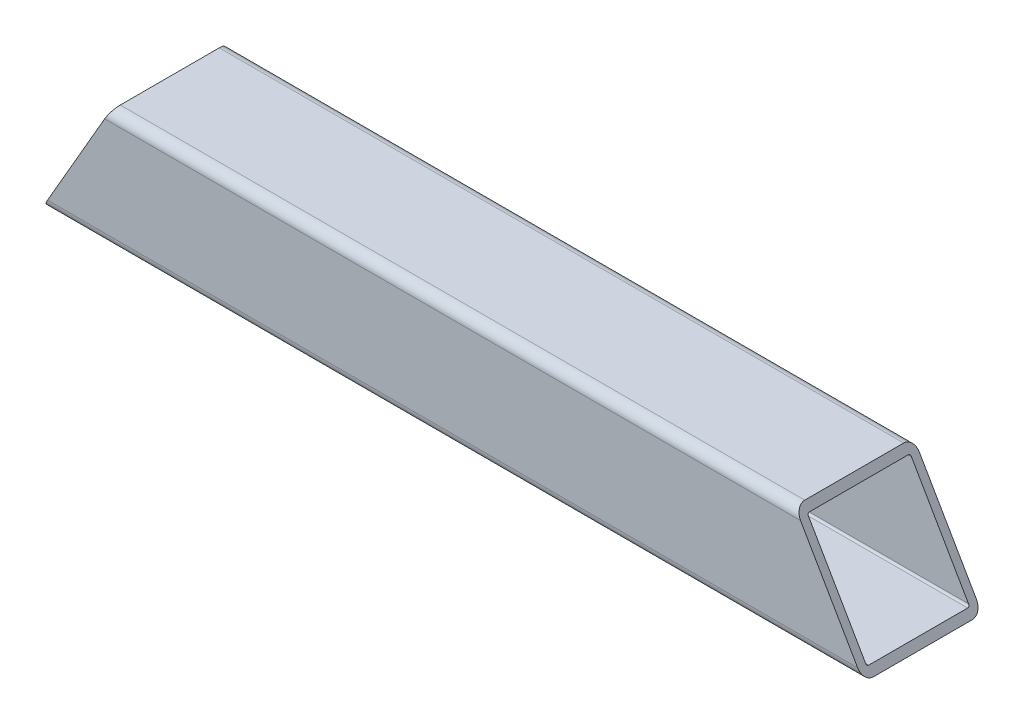
ISO-10303-21;
HEADER;
FILE_DESCRIPTION(('STEP AP214'),'2;1');
FILE_NAME('part.step','',(''),(''),'','','');
FILE_SCHEMA(('AUTOMOTIVE_DESIGN { 1 0 10303 214 1 1 1 1 }'));
ENDSEC;
DATA;
#1=APPLICATION_CONTEXT('core data for automotive mechanical design processes');
#2=APPLICATION_PROTOCOL_DEFINITION('international standard','automotive_design',2000,#1);
#3=PRODUCT_CONTEXT('',#1,'mechanical');
#4=PRODUCT('Part','Part','',(#3));
#5=PRODUCT_RELATED_PRODUCT_CATEGORY('part','',(#4));
#6=PRODUCT_DEFINITION_FORMATION('','',#4);
#7=PRODUCT_DEFINITION_CONTEXT('part definition',#1,'design');
#8=PRODUCT_DEFINITION('design','',#6,#7);
#9=PRODUCT_DEFINITION_SHAPE('','',#8);
#10=(LENGTH_UNIT() NAMED_UNIT(*) SI_UNIT(.MILLI.,.METRE.));
#11=(NAMED_UNIT(*) PLANE_ANGLE_UNIT() SI_UNIT($,.RADIAN.));
#12=(NAMED_UNIT(*) SI_UNIT($,.STERADIAN.) SOLID_ANGLE_UNIT());
#13=UNCERTAINTY_MEASURE_WITH_UNIT(LENGTH_MEASURE(1.E-05),#10,'distance_accuracy_value','');
#14=(GEOMETRIC_REPRESENTATION_CONTEXT(3) GLOBAL_UNCERTAINTY_ASSIGNED_CONTEXT((#13)) GLOBAL_UNIT_ASSIGNED_CONTEXT((#10,
#11,#12)) REPRESENTATION_CONTEXT('',''));
#15=CARTESIAN_POINT('',(0.,0.,0.));
#16=DIRECTION('',(0.,0.,1.));
#17=DIRECTION('',(1.,0.,0.));
#18=AXIS2_PLACEMENT_3D('',#15,#16,#17);
#19=CARTESIAN_POINT('',(131.7625,-15.875,15.875));
#20=DIRECTION('',(-1.,0.,0.));
#21=DIRECTION('',(0.,0.,1.));
#22=AXIS2_PLACEMENT_3D('',#19,#20,#21);
#23=CYLINDRICAL_SURFACE('',#22,3.175);
#24=DIRECTION('',(-1.,0.,0.));
#25=VECTOR('',#24,1.);
#26=CARTESIAN_POINT('',(131.7625,-19.05,15.875));
#27=LINE('',#26,#25);
#28=CARTESIAN_POINT('',(131.7625,-19.05,15.875));
#29=VERTEX_POINT('',#28);
#30=CARTESIAN_POINT('',(-131.7625,-19.05,15.875));
#31=VERTEX_POINT('',#30);
#32=EDGE_CURVE('E88',#29,#31,#27,.T.);
#33=ORIENTED_EDGE('',*,*,#32,.F.);
#34=CARTESIAN_POINT('',(129.929412895323,-15.875,15.875));
#35=DIRECTION('',(-0.866025403784442,-0.499999999999995,0.));
#36=DIRECTION('',(-0.499999999999995,0.866025403784442,0.));
#37=AXIS2_PLACEMENT_3D('',#34,#35,#36);
#38=ELLIPSE('',#37,3.66617420935411,3.175);
#39=CARTESIAN_POINT('',(129.929412895323,-15.875,19.05));
#40=VERTEX_POINT('',#39);
#41=EDGE_CURVE('E216',#29,#40,#38,.T.);
#42=ORIENTED_EDGE('',*,*,#41,.T.);
#43=DIRECTION('',(-1.,0.,0.));
#44=VECTOR('',#43,1.);
#45=CARTESIAN_POINT('',(131.7625,-15.875,19.05));
#46=LINE('',#45,#44);
#47=CARTESIAN_POINT('',(-129.929412895323,-15.875,19.05));
#48=VERTEX_POINT('',#47);
#49=EDGE_CURVE('E217',#40,#48,#46,.T.);
#50=ORIENTED_EDGE('',*,*,#49,.T.);
#51=CARTESIAN_POINT('',(-129.929412895323,-15.875,15.875));
#52=DIRECTION('',(-0.866025403784442,0.499999999999995,0.));
#53=DIRECTION('',(-0.499999999999995,-0.866025403784442,0.));
#54=AXIS2_PLACEMENT_3D('',#51,#52,#53);
#55=ELLIPSE('',#54,3.66617420935411,3.175);
#56=EDGE_CURVE('E239',#31,#48,#55,.T.);
#57=ORIENTED_EDGE('',*,*,#56,.F.);
#58=EDGE_LOOP('',(#33,#42,#50,#57));
#59=FACE_BOUND('',#58,.T.);
#60=ADVANCED_FACE('F81',(#59),#23,.T.);
#61=CARTESIAN_POINT('',(131.7625,-15.875,-15.875));
#62=DIRECTION('',(-1.,0.,0.));
#63=DIRECTION('',(0.,0.,1.));
#64=AXIS2_PLACEMENT_3D('',#61,#62,#63);
#65=CYLINDRICAL_SURFACE('',#64,3.175);
#66=DIRECTION('',(-1.,0.,0.));
#67=VECTOR('',#66,1.);
#68=CARTESIAN_POINT('',(131.7625,-15.875,-19.05));
#69=LINE('',#68,#67);
#70=CARTESIAN_POINT('',(129.929412895323,-15.875,-19.05));
#71=VERTEX_POINT('',#70);
#72=CARTESIAN_POINT('',(-129.929412895323,-15.875,-19.05));
#73=VERTEX_POINT('',#72);
#74=EDGE_CURVE('E205',#71,#73,#69,.T.);
#75=ORIENTED_EDGE('',*,*,#74,.F.);
#76=CARTESIAN_POINT('',(129.929412895323,-15.875,-15.875));
#77=DIRECTION('',(-0.866025403784442,-0.499999999999995,0.));
#78=DIRECTION('',(-0.499999999999995,0.866025403784442,0.));
#79=AXIS2_PLACEMENT_3D('',#76,#77,#78);
#80=ELLIPSE('',#79,3.66617420935411,3.175);
#81=CARTESIAN_POINT('',(131.7625,-19.05,-15.875));
#82=VERTEX_POINT('',#81);
#83=EDGE_CURVE('E208',#71,#82,#80,.T.);
#84=ORIENTED_EDGE('',*,*,#83,.T.);
#85=DIRECTION('',(-1.,0.,0.));
#86=VECTOR('',#85,1.);
#87=CARTESIAN_POINT('',(131.7625,-19.05,-15.875));
#88=LINE('',#87,#86);
#89=CARTESIAN_POINT('',(-131.7625,-19.05,-15.875));
#90=VERTEX_POINT('',#89);
#91=EDGE_CURVE('E193',#82,#90,#88,.T.);
#92=ORIENTED_EDGE('',*,*,#91,.T.);
#93=CARTESIAN_POINT('',(-129.929412895323,-15.875,-15.875));
#94=DIRECTION('',(-0.866025403784442,0.499999999999995,0.));
#95=DIRECTION('',(-0.499999999999995,-0.866025403784442,0.));
#96=AXIS2_PLACEMENT_3D('',#93,#94,#95);
#97=ELLIPSE('',#96,3.66617420935411,3.175);
#98=EDGE_CURVE('E240',#73,#90,#97,.T.);
#99=ORIENTED_EDGE('',*,*,#98,.F.);
#100=EDGE_LOOP('',(#75,#84,#92,#99));
#101=FACE_BOUND('',#100,.T.);
#102=ADVANCED_FACE('F209',(#101),#65,.T.);
#103=CARTESIAN_POINT('',(131.7625,15.875,-19.05));
#104=DIRECTION('',(0.,0.,1.));
#105=DIRECTION('',(0.,-1.,0.));
#106=AXIS2_PLACEMENT_3D('',#103,#104,#105);
#107=PLANE('',#106);
#108=DIRECTION('',(-1.,0.,0.));
#109=VECTOR('',#108,1.);
#110=CARTESIAN_POINT('',(131.7625,15.875,-19.05));
#111=LINE('',#110,#109);
#112=CARTESIAN_POINT('',(111.598541848553,15.875,-19.05));
#113=VERTEX_POINT('',#112);
#114=CARTESIAN_POINT('',(-111.598541848553,15.875,-19.05));
#115=VERTEX_POINT('',#114);
#116=EDGE_CURVE('E231',#113,#115,#111,.T.);
#117=ORIENTED_EDGE('',*,*,#116,.F.);
#118=DIRECTION('',(0.499999999999995,-0.866025403784442,0.));
#119=VECTOR('',#118,1.);
#120=CARTESIAN_POINT('',(116.639531386414,7.14375000000017,-19.05));
#121=LINE('',#120,#119);
#122=EDGE_CURVE('E95',#113,#71,#121,.T.);
#123=ORIENTED_EDGE('',*,*,#122,.T.);
#124=ORIENTED_EDGE('',*,*,#74,.T.);
#125=DIRECTION('',(-0.499999999999995,-0.866025403784442,0.));
#126=VECTOR('',#125,1.);
#127=CARTESIAN_POINT('',(-50.7582813864157,121.253422266146,-19.05));
#128=LINE('',#127,#126);
#129=EDGE_CURVE('E243',#115,#73,#128,.T.);
#130=ORIENTED_EDGE('',*,*,#129,.F.);
#131=EDGE_LOOP('',(#117,#123,#124,#130));
#132=FACE_BOUND('',#131,.T.);
#133=ADVANCED_FACE('F298',(#132),#107,.F.);
#134=CARTESIAN_POINT('',(131.7625,15.875,-15.875));
#135=DIRECTION('',(-1.,0.,0.));
#136=DIRECTION('',(0.,0.,1.));
#137=AXIS2_PLACEMENT_3D('',#134,#135,#136);
#138=CYLINDRICAL_SURFACE('',#137,3.175);
#139=DIRECTION('',(-1.,0.,0.));
#140=VECTOR('',#139,1.);
#141=CARTESIAN_POINT('',(131.7625,19.05,-15.875));
#142=LINE('',#141,#140);
#143=CARTESIAN_POINT('',(109.765454743876,19.05,-15.875));
#144=VERTEX_POINT('',#143);
#145=CARTESIAN_POINT('',(-109.765454743876,19.05,-15.875));
#146=VERTEX_POINT('',#145);
#147=EDGE_CURVE('E229',#144,#146,#142,.T.);
#148=ORIENTED_EDGE('',*,*,#147,.F.);
#149=CARTESIAN_POINT('',(111.598541848553,15.875,-15.875));
#150=DIRECTION('',(-0.866025403784442,-0.499999999999995,0.));
#151=DIRECTION('',(-0.499999999999995,0.866025403784442,0.));
#152=AXIS2_PLACEMENT_3D('',#149,#150,#151);
#153=ELLIPSE('',#152,3.66617420935412,3.175);
#154=EDGE_CURVE('E103',#144,#113,#153,.T.);
#155=ORIENTED_EDGE('',*,*,#154,.T.);
#156=ORIENTED_EDGE('',*,*,#116,.T.);
#157=CARTESIAN_POINT('',(-111.598541848553,15.875,-15.875));
#158=DIRECTION('',(-0.866025403784442,0.499999999999995,0.));
#159=DIRECTION('',(-0.499999999999995,-0.866025403784442,0.));
#160=AXIS2_PLACEMENT_3D('',#157,#158,#159);
#161=ELLIPSE('',#160,3.66617420935412,3.175);
#162=EDGE_CURVE('E248',#146,#115,#161,.T.);
#163=ORIENTED_EDGE('',*,*,#162,.F.);
#164=EDGE_LOOP('',(#148,#155,#156,#163));
#165=FACE_BOUND('',#164,.T.);
#166=ADVANCED_FACE('F297',(#165),#138,.T.);
#167=CARTESIAN_POINT('',(131.7625,19.05,15.875));
#168=DIRECTION('',(0.,-1.,0.));
#169=DIRECTION('',(0.,0.,-1.));
#170=AXIS2_PLACEMENT_3D('',#167,#168,#169);
#171=PLANE('',#170);
#172=DIRECTION('',(-1.,0.,0.));
#173=VECTOR('',#172,1.);
#174=CARTESIAN_POINT('',(131.7625,19.05,15.875));
#175=LINE('',#174,#173);
#176=CARTESIAN_POINT('',(109.765454743876,19.05,15.875));
#177=VERTEX_POINT('',#176);
#178=CARTESIAN_POINT('',(-109.765454743876,19.05,15.875));
#179=VERTEX_POINT('',#178);
#180=EDGE_CURVE('E227',#177,#179,#175,.T.);
#181=ORIENTED_EDGE('',*,*,#180,.F.);
#182=DIRECTION('',(0.,0.,-1.));
#183=VECTOR('',#182,1.);
#184=CARTESIAN_POINT('',(109.765454743876,19.05,359.240044371821));
#185=LINE('',#184,#183);
#186=EDGE_CURVE('E508',#177,#144,#185,.T.);
#187=ORIENTED_EDGE('',*,*,#186,.T.);
#188=ORIENTED_EDGE('',*,*,#147,.T.);
#189=DIRECTION('',(0.,0.,-1.));
#190=VECTOR('',#189,1.);
#191=CARTESIAN_POINT('',(-109.765454743876,19.05,359.240044371821));
#192=LINE('',#191,#190);
#193=EDGE_CURVE('E211',#179,#146,#192,.T.);
#194=ORIENTED_EDGE('',*,*,#193,.F.);
#195=EDGE_LOOP('',(#181,#187,#188,#194));
#196=FACE_BOUND('',#195,.T.);
#197=ADVANCED_FACE('F305',(#196),#171,.F.);
#198=CARTESIAN_POINT('',(131.7625,15.875,15.875));
#199=DIRECTION('',(-1.,0.,0.));
#200=DIRECTION('',(0.,0.,1.));
#201=AXIS2_PLACEMENT_3D('',#198,#199,#200);
#202=CYLINDRICAL_SURFACE('',#201,3.175);
#203=DIRECTION('',(-1.,0.,0.));
#204=VECTOR('',#203,1.);
#205=CARTESIAN_POINT('',(131.7625,15.875,19.05));
#206=LINE('',#205,#204);
#207=CARTESIAN_POINT('',(111.598541848553,15.875,19.05));
#208=VERTEX_POINT('',#207);
#209=CARTESIAN_POINT('',(-111.598541848553,15.875,19.05));
#210=VERTEX_POINT('',#209);
#211=EDGE_CURVE('E219',#208,#210,#206,.T.);
#212=ORIENTED_EDGE('',*,*,#211,.F.);
#213=CARTESIAN_POINT('',(111.598541848553,15.875,15.875));
#214=DIRECTION('',(-0.866025403784442,-0.499999999999995,0.));
#215=DIRECTION('',(-0.499999999999995,0.866025403784442,0.));
#216=AXIS2_PLACEMENT_3D('',#213,#214,#215);
#217=ELLIPSE('',#216,3.66617420935412,3.175);
#218=EDGE_CURVE('E473',#208,#177,#217,.T.);
#219=ORIENTED_EDGE('',*,*,#218,.T.);
#220=ORIENTED_EDGE('',*,*,#180,.T.);
#221=CARTESIAN_POINT('',(-111.598541848553,15.875,15.875));
#222=DIRECTION('',(-0.866025403784442,0.499999999999995,0.));
#223=DIRECTION('',(-0.499999999999995,-0.866025403784442,0.));
#224=AXIS2_PLACEMENT_3D('',#221,#222,#223);
#225=ELLIPSE('',#224,3.66617420935412,3.175);
#226=EDGE_CURVE('E291',#210,#179,#225,.T.);
#227=ORIENTED_EDGE('',*,*,#226,.F.);
#228=EDGE_LOOP('',(#212,#219,#220,#227));
#229=FACE_BOUND('',#228,.T.);
#230=ADVANCED_FACE('F335',(#229),#202,.T.);
#231=CARTESIAN_POINT('',(131.7625,15.875,19.05));
#232=DIRECTION('',(0.,0.,-1.));
#233=DIRECTION('',(0.,1.,0.));
#234=AXIS2_PLACEMENT_3D('',#231,#232,#233);
#235=PLANE('',#234);
#236=ORIENTED_EDGE('',*,*,#49,.F.);
#237=DIRECTION('',(-0.499999999999995,0.866025403784442,0.));
#238=VECTOR('',#237,1.);
#239=CARTESIAN_POINT('',(116.639531386414,7.14375000000017,19.05));
#240=LINE('',#239,#238);
#241=EDGE_CURVE('E466',#40,#208,#240,.T.);
#242=ORIENTED_EDGE('',*,*,#241,.T.);
#243=ORIENTED_EDGE('',*,*,#211,.T.);
#244=DIRECTION('',(0.499999999999995,0.866025403784442,0.));
#245=VECTOR('',#244,1.);
#246=CARTESIAN_POINT('',(-50.7582813864157,121.253422266146,19.05));
#247=LINE('',#246,#245);
#248=EDGE_CURVE('E281',#48,#210,#247,.T.);
#249=ORIENTED_EDGE('',*,*,#248,.F.);
#250=EDGE_LOOP('',(#236,#242,#243,#249));
#251=FACE_BOUND('',#250,.T.);
#252=ADVANCED_FACE('F345',(#251),#235,.F.);
#253=CARTESIAN_POINT('',(131.7625,-15.875,15.875));
#254=DIRECTION('',(-1.,0.,0.));
#255=DIRECTION('',(0.,0.,1.));
#256=AXIS2_PLACEMENT_3D('',#253,#254,#255);
#257=CYLINDRICAL_SURFACE('',#256,0.635000000000002);
#258=CARTESIAN_POINT('',(129.929412895323,-15.875,15.875));
#259=DIRECTION('',(-0.866025403784442,-0.499999999999995,0.));
#260=DIRECTION('',(-0.499999999999995,0.866025403784442,0.));
#261=AXIS2_PLACEMENT_3D('',#258,#259,#260);
#262=ELLIPSE('',#261,0.733234841870825,0.635000000000002);
#263=CARTESIAN_POINT('',(130.296030316258,-16.51,15.875));
#264=VERTEX_POINT('',#263);
#265=CARTESIAN_POINT('',(129.929412895323,-15.875,16.51));
#266=VERTEX_POINT('',#265);
#267=EDGE_CURVE('E273',#264,#266,#262,.T.);
#268=ORIENTED_EDGE('',*,*,#267,.F.);
#269=DIRECTION('',(-1.,0.,0.));
#270=VECTOR('',#269,1.);
#271=CARTESIAN_POINT('',(131.7625,-16.51,15.875));
#272=LINE('',#271,#270);
#273=CARTESIAN_POINT('',(-130.296030316258,-16.51,15.875));
#274=VERTEX_POINT('',#273);
#275=EDGE_CURVE('E221',#264,#274,#272,.T.);
#276=ORIENTED_EDGE('',*,*,#275,.T.);
#277=CARTESIAN_POINT('',(-129.929412895323,-15.875,15.875));
#278=DIRECTION('',(-0.866025403784442,0.499999999999995,0.));
#279=DIRECTION('',(-0.499999999999995,-0.866025403784442,0.));
#280=AXIS2_PLACEMENT_3D('',#277,#278,#279);
#281=ELLIPSE('',#280,0.733234841870825,0.635000000000002);
#282=CARTESIAN_POINT('',(-129.929412895323,-15.875,16.51));
#283=VERTEX_POINT('',#282);
#284=EDGE_CURVE('E271',#274,#283,#281,.T.);
#285=ORIENTED_EDGE('',*,*,#284,.T.);
#286=DIRECTION('',(-1.,0.,0.));
#287=VECTOR('',#286,1.);
#288=CARTESIAN_POINT('',(131.7625,-15.875,16.51));
#289=LINE('',#288,#287);
#290=EDGE_CURVE('E244',#266,#283,#289,.T.);
#291=ORIENTED_EDGE('',*,*,#290,.F.);
#292=EDGE_LOOP('',(#268,#276,#285,#291));
#293=FACE_BOUND('',#292,.T.);
#294=ADVANCED_FACE('F269',(#293),#257,.F.);
#295=CARTESIAN_POINT('',(131.7625,-16.51,15.875));
#296=DIRECTION('',(0.,1.,0.));
#297=DIRECTION('',(0.,0.,1.));
#298=AXIS2_PLACEMENT_3D('',#295,#296,#297);
#299=PLANE('',#298);
#300=DIRECTION('',(0.,0.,1.));
#301=VECTOR('',#300,1.);
#302=CARTESIAN_POINT('',(130.296030316258,-16.51,15.875));
#303=LINE('',#302,#301);
#304=CARTESIAN_POINT('',(130.296030316258,-16.51,-15.875));
#305=VERTEX_POINT('',#304);
#306=EDGE_CURVE('E461',#305,#264,#303,.T.);
#307=ORIENTED_EDGE('',*,*,#306,.F.);
#308=DIRECTION('',(-1.,0.,0.));
#309=VECTOR('',#308,1.);
#310=CARTESIAN_POINT('',(131.7625,-16.51,-15.875));
#311=LINE('',#310,#309);
#312=CARTESIAN_POINT('',(-130.296030316258,-16.51,-15.875));
#313=VERTEX_POINT('',#312);
#314=EDGE_CURVE('E260',#305,#313,#311,.T.);
#315=ORIENTED_EDGE('',*,*,#314,.T.);
#316=DIRECTION('',(0.,0.,1.));
#317=VECTOR('',#316,1.);
#318=CARTESIAN_POINT('',(-130.296030316258,-16.51,15.875));
#319=LINE('',#318,#317);
#320=EDGE_CURVE('E278',#313,#274,#319,.T.);
#321=ORIENTED_EDGE('',*,*,#320,.T.);
#322=ORIENTED_EDGE('',*,*,#275,.F.);
#323=EDGE_LOOP('',(#307,#315,#321,#322));
#324=FACE_BOUND('',#323,.T.);
#325=ADVANCED_FACE('F283',(#324),#299,.T.);
#326=CARTESIAN_POINT('',(131.7625,-15.875,-15.875));
#327=DIRECTION('',(-1.,0.,0.));
#328=DIRECTION('',(0.,0.,1.));
#329=AXIS2_PLACEMENT_3D('',#326,#327,#328);
#330=CYLINDRICAL_SURFACE('',#329,0.634999999999999);
#331=CARTESIAN_POINT('',(129.929412895323,-15.875,-15.875));
#332=DIRECTION('',(-0.866025403784442,-0.499999999999995,0.));
#333=DIRECTION('',(-0.499999999999995,0.866025403784442,0.));
#334=AXIS2_PLACEMENT_3D('',#331,#332,#333);
#335=ELLIPSE('',#334,0.733234841870821,0.634999999999999);
#336=CARTESIAN_POINT('',(129.929412895323,-15.875,-16.51));
#337=VERTEX_POINT('',#336);
#338=EDGE_CURVE('E464',#337,#305,#335,.T.);
#339=ORIENTED_EDGE('',*,*,#338,.F.);
#340=DIRECTION('',(-1.,0.,0.));
#341=VECTOR('',#340,1.);
#342=CARTESIAN_POINT('',(131.7625,-15.875,-16.51));
#343=LINE('',#342,#341);
#344=CARTESIAN_POINT('',(-129.929412895323,-15.875,-16.51));
#345=VERTEX_POINT('',#344);
#346=EDGE_CURVE('E259',#337,#345,#343,.T.);
#347=ORIENTED_EDGE('',*,*,#346,.T.);
#348=CARTESIAN_POINT('',(-129.929412895323,-15.875,-15.875));
#349=DIRECTION('',(-0.866025403784442,0.499999999999995,0.));
#350=DIRECTION('',(-0.499999999999995,-0.866025403784442,0.));
#351=AXIS2_PLACEMENT_3D('',#348,#349,#350);
#352=ELLIPSE('',#351,0.733234841870821,0.634999999999999);
#353=EDGE_CURVE('E284',#345,#313,#352,.T.);
#354=ORIENTED_EDGE('',*,*,#353,.T.);
#355=ORIENTED_EDGE('',*,*,#314,.F.);
#356=EDGE_LOOP('',(#339,#347,#354,#355));
#357=FACE_BOUND('',#356,.T.);
#358=ADVANCED_FACE('F372',(#357),#330,.F.);
#359=CARTESIAN_POINT('',(131.7625,15.875,-16.51));
#360=DIRECTION('',(0.,0.,1.));
#361=DIRECTION('',(0.,-1.,0.));
#362=AXIS2_PLACEMENT_3D('',#359,#360,#361);
#363=PLANE('',#362);
#364=DIRECTION('',(0.499999999999995,-0.866025403784442,0.));
#365=VECTOR('',#364,1.);
#366=CARTESIAN_POINT('',(116.639531386414,7.14375000000017,-16.51));
#367=LINE('',#366,#365);
#368=CARTESIAN_POINT('',(111.598541848553,15.875,-16.51));
#369=VERTEX_POINT('',#368);
#370=EDGE_CURVE('E468',#369,#337,#367,.T.);
#371=ORIENTED_EDGE('',*,*,#370,.F.);
#372=DIRECTION('',(-1.,0.,0.));
#373=VECTOR('',#372,1.);
#374=CARTESIAN_POINT('',(131.7625,15.875,-16.51));
#375=LINE('',#374,#373);
#376=CARTESIAN_POINT('',(-111.598541848553,15.875,-16.51));
#377=VERTEX_POINT('',#376);
#378=EDGE_CURVE('E257',#369,#377,#375,.T.);
#379=ORIENTED_EDGE('',*,*,#378,.T.);
#380=DIRECTION('',(-0.499999999999995,-0.866025403784442,0.));
#381=VECTOR('',#380,1.);
#382=CARTESIAN_POINT('',(-50.7582813864157,121.253422266146,-16.51));
#383=LINE('',#382,#381);
#384=EDGE_CURVE('E286',#377,#345,#383,.T.);
#385=ORIENTED_EDGE('',*,*,#384,.T.);
#386=ORIENTED_EDGE('',*,*,#346,.F.);
#387=EDGE_LOOP('',(#371,#379,#385,#386));
#388=FACE_BOUND('',#387,.T.);
#389=ADVANCED_FACE('F381',(#388),#363,.T.);
#390=CARTESIAN_POINT('',(131.7625,15.875,-15.875));
#391=DIRECTION('',(-1.,0.,0.));
#392=DIRECTION('',(0.,0.,1.));
#393=AXIS2_PLACEMENT_3D('',#390,#391,#392);
#394=CYLINDRICAL_SURFACE('',#393,0.635000000000004);
#395=CARTESIAN_POINT('',(111.598541848553,15.875,-15.875));
#396=DIRECTION('',(-0.866025403784442,-0.499999999999995,0.));
#397=DIRECTION('',(-0.499999999999995,0.866025403784442,0.));
#398=AXIS2_PLACEMENT_3D('',#395,#396,#397);
#399=ELLIPSE('',#398,0.733234841870827,0.635000000000004);
#400=CARTESIAN_POINT('',(111.231924427617,16.51,-15.875));
#401=VERTEX_POINT('',#400);
#402=EDGE_CURVE('E495',#401,#369,#399,.T.);
#403=ORIENTED_EDGE('',*,*,#402,.F.);
#404=DIRECTION('',(-1.,0.,0.));
#405=VECTOR('',#404,1.);
#406=CARTESIAN_POINT('',(131.7625,16.51,-15.875));
#407=LINE('',#406,#405);
#408=CARTESIAN_POINT('',(-111.231924427617,16.51,-15.875));
#409=VERTEX_POINT('',#408);
#410=EDGE_CURVE('E255',#401,#409,#407,.T.);
#411=ORIENTED_EDGE('',*,*,#410,.T.);
#412=CARTESIAN_POINT('',(-111.598541848553,15.875,-15.875));
#413=DIRECTION('',(-0.866025403784442,0.499999999999995,0.));
#414=DIRECTION('',(-0.499999999999995,-0.866025403784442,0.));
#415=AXIS2_PLACEMENT_3D('',#412,#413,#414);
#416=ELLIPSE('',#415,0.733234841870827,0.635000000000004);
#417=EDGE_CURVE('E485',#409,#377,#416,.T.);
#418=ORIENTED_EDGE('',*,*,#417,.T.);
#419=ORIENTED_EDGE('',*,*,#378,.F.);
#420=EDGE_LOOP('',(#403,#411,#418,#419));
#421=FACE_BOUND('',#420,.T.);
#422=ADVANCED_FACE('F391',(#421),#394,.F.);
#423=CARTESIAN_POINT('',(131.7625,16.51,15.875));
#424=DIRECTION('',(0.,-1.,0.));
#425=DIRECTION('',(0.,0.,-1.));
#426=AXIS2_PLACEMENT_3D('',#423,#424,#425);
#427=PLANE('',#426);
#428=DIRECTION('',(0.,0.,-1.));
#429=VECTOR('',#428,1.);
#430=CARTESIAN_POINT('',(111.231924427617,16.51,15.875));
#431=LINE('',#430,#429);
#432=CARTESIAN_POINT('',(111.231924427617,16.51,15.875));
#433=VERTEX_POINT('',#432);
#434=EDGE_CURVE('E497',#433,#401,#431,.T.);
#435=ORIENTED_EDGE('',*,*,#434,.F.);
#436=DIRECTION('',(-1.,0.,0.));
#437=VECTOR('',#436,1.);
#438=CARTESIAN_POINT('',(131.7625,16.51,15.875));
#439=LINE('',#438,#437);
#440=CARTESIAN_POINT('',(-111.231924427617,16.51,15.875));
#441=VERTEX_POINT('',#440);
#442=EDGE_CURVE('E253',#433,#441,#439,.T.);
#443=ORIENTED_EDGE('',*,*,#442,.T.);
#444=DIRECTION('',(0.,0.,-1.));
#445=VECTOR('',#444,1.);
#446=CARTESIAN_POINT('',(-111.231924427617,16.51,15.875));
#447=LINE('',#446,#445);
#448=EDGE_CURVE('E482',#441,#409,#447,.T.);
#449=ORIENTED_EDGE('',*,*,#448,.T.);
#450=ORIENTED_EDGE('',*,*,#410,.F.);
#451=EDGE_LOOP('',(#435,#443,#449,#450));
#452=FACE_BOUND('',#451,.T.);
#453=ADVANCED_FACE('F401',(#452),#427,.T.);
#454=CARTESIAN_POINT('',(131.7625,15.875,15.875));
#455=DIRECTION('',(-1.,0.,0.));
#456=DIRECTION('',(0.,0.,1.));
#457=AXIS2_PLACEMENT_3D('',#454,#455,#456);
#458=CYLINDRICAL_SURFACE('',#457,0.635000000000004);
#459=CARTESIAN_POINT('',(111.598541848553,15.875,15.875));
#460=DIRECTION('',(-0.866025403784442,-0.499999999999995,0.));
#461=DIRECTION('',(-0.499999999999995,0.866025403784442,0.));
#462=AXIS2_PLACEMENT_3D('',#459,#460,#461);
#463=ELLIPSE('',#462,0.733234841870827,0.635000000000004);
#464=CARTESIAN_POINT('',(111.598541848553,15.875,16.51));
#465=VERTEX_POINT('',#464);
#466=EDGE_CURVE('E501',#465,#433,#463,.T.);
#467=ORIENTED_EDGE('',*,*,#466,.F.);
#468=DIRECTION('',(-1.,0.,0.));
#469=VECTOR('',#468,1.);
#470=CARTESIAN_POINT('',(131.7625,15.875,16.51));
#471=LINE('',#470,#469);
#472=CARTESIAN_POINT('',(-111.598541848553,15.875,16.51));
#473=VERTEX_POINT('',#472);
#474=EDGE_CURVE('E246',#465,#473,#471,.T.);
#475=ORIENTED_EDGE('',*,*,#474,.T.);
#476=CARTESIAN_POINT('',(-111.598541848553,15.875,15.875));
#477=DIRECTION('',(-0.866025403784442,0.499999999999995,0.));
#478=DIRECTION('',(-0.499999999999995,-0.866025403784442,0.));
#479=AXIS2_PLACEMENT_3D('',#476,#477,#478);
#480=ELLIPSE('',#479,0.733234841870827,0.635000000000004);
#481=EDGE_CURVE('E479',#473,#441,#480,.T.);
#482=ORIENTED_EDGE('',*,*,#481,.T.);
#483=ORIENTED_EDGE('',*,*,#442,.F.);
#484=EDGE_LOOP('',(#467,#475,#482,#483));
#485=FACE_BOUND('',#484,.T.);
#486=ADVANCED_FACE('F411',(#485),#458,.F.);
#487=CARTESIAN_POINT('',(131.7625,15.875,16.51));
#488=DIRECTION('',(0.,0.,-1.));
#489=DIRECTION('',(0.,1.,0.));
#490=AXIS2_PLACEMENT_3D('',#487,#488,#489);
#491=PLANE('',#490);
#492=DIRECTION('',(-0.499999999999995,0.866025403784442,0.));
#493=VECTOR('',#492,1.);
#494=CARTESIAN_POINT('',(116.639531386414,7.14375000000017,16.51));
#495=LINE('',#494,#493);
#496=EDGE_CURVE('E504',#266,#465,#495,.T.);
#497=ORIENTED_EDGE('',*,*,#496,.F.);
#498=ORIENTED_EDGE('',*,*,#290,.T.);
#499=DIRECTION('',(0.499999999999995,0.866025403784442,0.));
#500=VECTOR('',#499,1.);
#501=CARTESIAN_POINT('',(-50.7582813864157,121.253422266146,16.51));
#502=LINE('',#501,#500);
#503=EDGE_CURVE('E12',#283,#473,#502,.T.);
#504=ORIENTED_EDGE('',*,*,#503,.T.);
#505=ORIENTED_EDGE('',*,*,#474,.F.);
#506=EDGE_LOOP('',(#497,#498,#504,#505));
#507=FACE_BOUND('',#506,.T.);
#508=ADVANCED_FACE('F421',(#507),#491,.T.);
#509=CARTESIAN_POINT('',(131.7625,-19.05,15.875));
#510=DIRECTION('',(0.,1.,0.));
#511=DIRECTION('',(0.,0.,1.));
#512=AXIS2_PLACEMENT_3D('',#509,#510,#511);
#513=PLANE('',#512);
#514=DIRECTION('',(0.,0.,-1.));
#515=VECTOR('',#514,1.);
#516=CARTESIAN_POINT('',(-131.7625,-19.05,15.875));
#517=LINE('',#516,#515);
#518=EDGE_CURVE('E201',#31,#90,#517,.T.);
#519=ORIENTED_EDGE('',*,*,#518,.T.);
#520=ORIENTED_EDGE('',*,*,#91,.F.);
#521=DIRECTION('',(0.,0.,-1.));
#522=VECTOR('',#521,1.);
#523=CARTESIAN_POINT('',(131.7625,-19.05,15.875));
#524=LINE('',#523,#522);
#525=EDGE_CURVE('E198',#29,#82,#524,.T.);
#526=ORIENTED_EDGE('',*,*,#525,.F.);
#527=ORIENTED_EDGE('',*,*,#32,.T.);
#528=EDGE_LOOP('',(#519,#520,#526,#527));
#529=FACE_BOUND('',#528,.T.);
#530=ADVANCED_FACE('F195',(#529),#513,.F.);
#531=CARTESIAN_POINT('',(-131.7625,-19.05,359.240044371821));
#532=DIRECTION('',(-0.866025403784442,0.499999999999995,0.));
#533=DIRECTION('',(-0.499999999999995,-0.866025403784442,0.));
#534=AXIS2_PLACEMENT_3D('',#531,#532,#533);
#535=PLANE('',#534);
#536=ORIENTED_EDGE('',*,*,#284,.F.);
#537=ORIENTED_EDGE('',*,*,#320,.F.);
#538=ORIENTED_EDGE('',*,*,#353,.F.);
#539=ORIENTED_EDGE('',*,*,#384,.F.);
#540=ORIENTED_EDGE('',*,*,#417,.F.);
#541=ORIENTED_EDGE('',*,*,#448,.F.);
#542=ORIENTED_EDGE('',*,*,#481,.F.);
#543=ORIENTED_EDGE('',*,*,#503,.F.);
#544=EDGE_LOOP('',(#536,#537,#538,#539,#540,#541,#542,#543));
#545=FACE_BOUND('',#544,.T.);
#546=ORIENTED_EDGE('',*,*,#129,.T.);
#547=ORIENTED_EDGE('',*,*,#98,.T.);
#548=ORIENTED_EDGE('',*,*,#518,.F.);
#549=ORIENTED_EDGE('',*,*,#56,.T.);
#550=ORIENTED_EDGE('',*,*,#248,.T.);
#551=ORIENTED_EDGE('',*,*,#226,.T.);
#552=ORIENTED_EDGE('',*,*,#193,.T.);
#553=ORIENTED_EDGE('',*,*,#162,.T.);
#554=EDGE_LOOP('',(#546,#547,#548,#549,#550,#551,#552,#553));
#555=FACE_BOUND('',#554,.T.);
#556=ADVANCED_FACE('F237',(#545,#555),#535,.T.);
#557=CARTESIAN_POINT('',(131.7625,-19.05,359.240044371821));
#558=DIRECTION('',(-0.866025403784442,-0.499999999999995,0.));
#559=DIRECTION('',(0.499999999999995,-0.866025403784442,0.));
#560=AXIS2_PLACEMENT_3D('',#557,#558,#559);
#561=PLANE('',#560);
#562=ORIENTED_EDGE('',*,*,#306,.T.);
#563=ORIENTED_EDGE('',*,*,#267,.T.);
#564=ORIENTED_EDGE('',*,*,#496,.T.);
#565=ORIENTED_EDGE('',*,*,#466,.T.);
#566=ORIENTED_EDGE('',*,*,#434,.T.);
#567=ORIENTED_EDGE('',*,*,#402,.T.);
#568=ORIENTED_EDGE('',*,*,#370,.T.);
#569=ORIENTED_EDGE('',*,*,#338,.T.);
#570=EDGE_LOOP('',(#562,#563,#564,#565,#566,#567,#568,#569));
#571=FACE_BOUND('',#570,.T.);
#572=ORIENTED_EDGE('',*,*,#83,.F.);
#573=ORIENTED_EDGE('',*,*,#122,.F.);
#574=ORIENTED_EDGE('',*,*,#154,.F.);
#575=ORIENTED_EDGE('',*,*,#186,.F.);
#576=ORIENTED_EDGE('',*,*,#218,.F.);
#577=ORIENTED_EDGE('',*,*,#241,.F.);
#578=ORIENTED_EDGE('',*,*,#41,.F.);
#579=ORIENTED_EDGE('',*,*,#525,.T.);
#580=EDGE_LOOP('',(#572,#573,#574,#575,#576,#577,#578,#579));
#581=FACE_BOUND('',#580,.T.);
#582=ADVANCED_FACE('F214',(#571,#581),#561,.F.);
#583=CLOSED_SHELL('',(#60,#102,#133,#166,#197,#230,#252,#294,#325,#358,#389,#422,#453,#486,#508,
#530,#556,#582));
#584=MANIFOLD_SOLID_BREP('B2',#583);
#585=ADVANCED_BREP_SHAPE_REPRESENTATION('',(#18,#584),#14);
#586=SHAPE_DEFINITION_REPRESENTATION(#9,#585);
ENDSEC;
END-ISO-10303-21;
